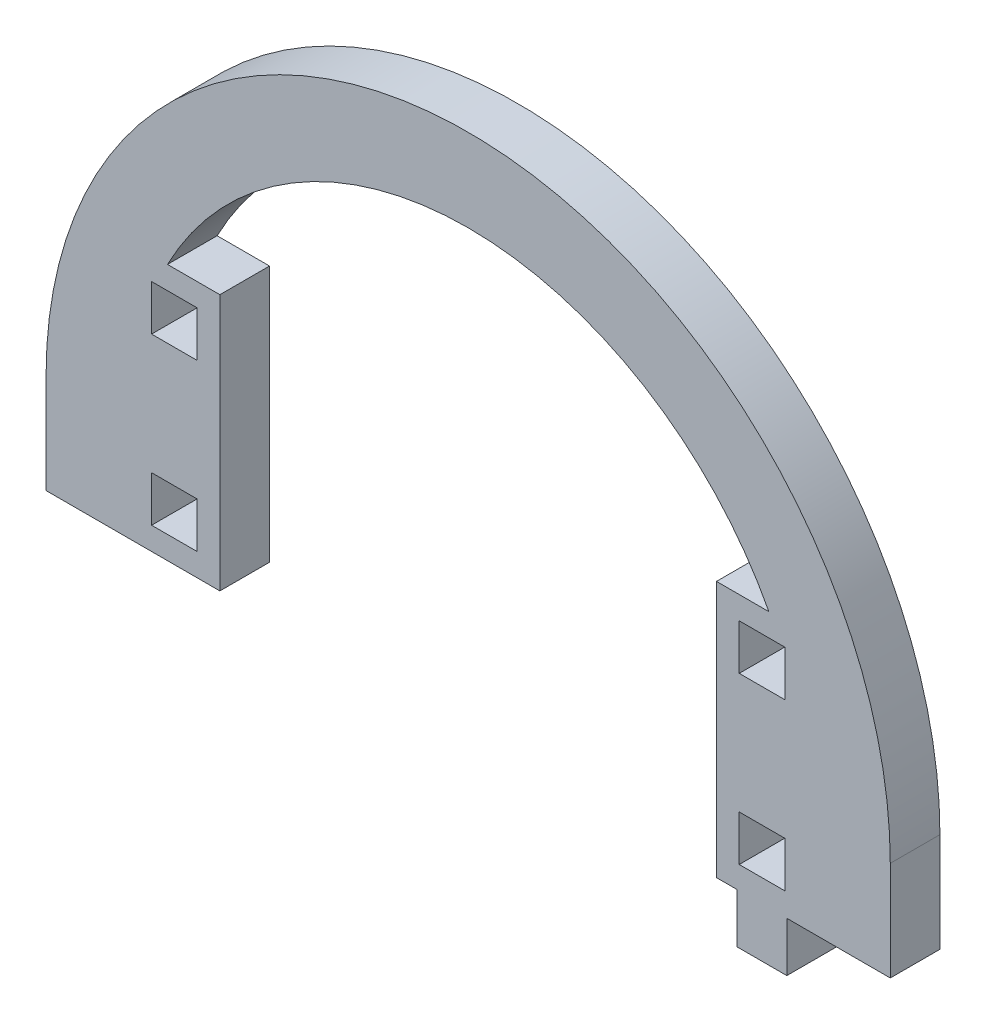
ISO-10303-21;
HEADER;
FILE_DESCRIPTION(('STEP AP214'),'2;1');
FILE_NAME('part.step','',(''),(''),'','','');
FILE_SCHEMA(('AUTOMOTIVE_DESIGN { 1 0 10303 214 1 1 1 1 }'));
ENDSEC;
DATA;
#1=APPLICATION_CONTEXT('core data for automotive mechanical design processes');
#2=APPLICATION_PROTOCOL_DEFINITION('international standard','automotive_design',2000,#1);
#3=PRODUCT_CONTEXT('',#1,'mechanical');
#4=PRODUCT('Part','Part','',(#3));
#5=PRODUCT_RELATED_PRODUCT_CATEGORY('part','',(#4));
#6=PRODUCT_DEFINITION_FORMATION('','',#4);
#7=PRODUCT_DEFINITION_CONTEXT('part definition',#1,'design');
#8=PRODUCT_DEFINITION('design','',#6,#7);
#9=PRODUCT_DEFINITION_SHAPE('','',#8);
#10=(LENGTH_UNIT() NAMED_UNIT(*) SI_UNIT(.MILLI.,.METRE.));
#11=(NAMED_UNIT(*) PLANE_ANGLE_UNIT() SI_UNIT($,.RADIAN.));
#12=(NAMED_UNIT(*) SI_UNIT($,.STERADIAN.) SOLID_ANGLE_UNIT());
#13=UNCERTAINTY_MEASURE_WITH_UNIT(LENGTH_MEASURE(1.E-05),#10,'distance_accuracy_value','');
#14=(GEOMETRIC_REPRESENTATION_CONTEXT(3) GLOBAL_UNCERTAINTY_ASSIGNED_CONTEXT((#13)) GLOBAL_UNIT_ASSIGNED_CONTEXT((#10,
#11,#12)) REPRESENTATION_CONTEXT('',''));
#15=CARTESIAN_POINT('',(0.,0.,0.));
#16=DIRECTION('',(0.,0.,1.));
#17=DIRECTION('',(1.,0.,0.));
#18=AXIS2_PLACEMENT_3D('',#15,#16,#17);
#19=CARTESIAN_POINT('',(3063.61709474341,1236.94724493334,6.));
#20=DIRECTION('',(0.,0.,1.));
#21=DIRECTION('',(1.,0.,0.));
#22=AXIS2_PLACEMENT_3D('',#19,#20,#21);
#23=PLANE('',#22);
#24=CARTESIAN_POINT('',(3063.61709474341,1236.94724493334,6.));
#25=DIRECTION('',(0.,0.,1.));
#26=DIRECTION('',(1.,0.,0.));
#27=AXIS2_PLACEMENT_3D('',#24,#25,#26);
#28=CIRCLE('',#27,50.9999999999999);
#29=CARTESIAN_POINT('',(3114.61709474341,1236.94724493334,6.));
#30=VERTEX_POINT('',#29);
#31=CARTESIAN_POINT('',(3012.61709474341,1236.94724493334,6.));
#32=VERTEX_POINT('',#31);
#33=EDGE_CURVE('E642',#30,#32,#28,.T.);
#34=ORIENTED_EDGE('',*,*,#33,.T.);
#35=DIRECTION('',(0.,-1.,0.));
#36=VECTOR('',#35,1.);
#37=CARTESIAN_POINT('',(3012.61709474341,1236.94724493334,6.));
#38=LINE('',#37,#36);
#39=CARTESIAN_POINT('',(3012.61709474341,1224.94724493334,6.));
#40=VERTEX_POINT('',#39);
#41=EDGE_CURVE('E646',#32,#40,#38,.T.);
#42=ORIENTED_EDGE('',*,*,#41,.T.);
#43=DIRECTION('',(-1.,0.,0.));
#44=VECTOR('',#43,1.);
#45=CARTESIAN_POINT('',(3022.61709474341,1224.94724493334,6.));
#46=LINE('',#45,#44);
#47=CARTESIAN_POINT('',(3033.61709474341,1224.94724493334,6.));
#48=VERTEX_POINT('',#47);
#49=EDGE_CURVE('E650',#48,#40,#46,.T.);
#50=ORIENTED_EDGE('',*,*,#49,.F.);
#51=DIRECTION('',(0.,-1.,0.));
#52=VECTOR('',#51,1.);
#53=CARTESIAN_POINT('',(3033.61709474341,1255.94724493334,6.));
#54=LINE('',#53,#52);
#55=CARTESIAN_POINT('',(3033.61709474341,1255.94724493334,6.));
#56=VERTEX_POINT('',#55);
#57=EDGE_CURVE('E654',#56,#48,#54,.T.);
#58=ORIENTED_EDGE('',*,*,#57,.F.);
#59=DIRECTION('',(-1.,0.,0.));
#60=VECTOR('',#59,1.);
#61=CARTESIAN_POINT('',(3033.61709474341,1255.94724493334,6.));
#62=LINE('',#61,#60);
#63=CARTESIAN_POINT('',(3027.28529049424,1255.94724493334,6.));
#64=VERTEX_POINT('',#63);
#65=EDGE_CURVE('E658',#56,#64,#62,.T.);
#66=ORIENTED_EDGE('',*,*,#65,.T.);
#67=CARTESIAN_POINT('',(3063.61709474341,1236.94724493334,6.));
#68=DIRECTION('',(0.,0.,1.));
#69=DIRECTION('',(1.,0.,0.));
#70=AXIS2_PLACEMENT_3D('',#67,#68,#69);
#71=CIRCLE('',#70,41.0000000000001);
#72=CARTESIAN_POINT('',(3099.94889899258,1255.94724493334,6.));
#73=VERTEX_POINT('',#72);
#74=EDGE_CURVE('E661',#73,#64,#71,.T.);
#75=ORIENTED_EDGE('',*,*,#74,.F.);
#76=DIRECTION('',(-1.,0.,0.));
#77=VECTOR('',#76,1.);
#78=CARTESIAN_POINT('',(3099.94889899258,1255.94724493334,6.));
#79=LINE('',#78,#77);
#80=CARTESIAN_POINT('',(3093.61709474341,1255.94724493334,6.));
#81=VERTEX_POINT('',#80);
#82=EDGE_CURVE('E665',#73,#81,#79,.T.);
#83=ORIENTED_EDGE('',*,*,#82,.T.);
#84=DIRECTION('',(0.,-1.,0.));
#85=VECTOR('',#84,1.);
#86=CARTESIAN_POINT('',(3093.61709474341,1255.94724493334,6.));
#87=LINE('',#86,#85);
#88=CARTESIAN_POINT('',(3093.61709474341,1224.94724493334,6.));
#89=VERTEX_POINT('',#88);
#90=EDGE_CURVE('E668',#81,#89,#87,.T.);
#91=ORIENTED_EDGE('',*,*,#90,.T.);
#92=DIRECTION('',(1.,0.,0.));
#93=VECTOR('',#92,1.);
#94=CARTESIAN_POINT('',(3093.61709474341,1224.94724493334,6.));
#95=LINE('',#94,#93);
#96=CARTESIAN_POINT('',(3096.11709474341,1224.94724493334,6.));
#97=VERTEX_POINT('',#96);
#98=EDGE_CURVE('E671',#89,#97,#95,.T.);
#99=ORIENTED_EDGE('',*,*,#98,.T.);
#100=DIRECTION('',(0.,-1.,0.));
#101=VECTOR('',#100,1.);
#102=CARTESIAN_POINT('',(3096.11709474341,1224.94724493334,6.));
#103=LINE('',#102,#101);
#104=CARTESIAN_POINT('',(3096.11709474341,1218.94724493334,6.));
#105=VERTEX_POINT('',#104);
#106=EDGE_CURVE('E674',#97,#105,#103,.T.);
#107=ORIENTED_EDGE('',*,*,#106,.T.);
#108=DIRECTION('',(1.,0.,0.));
#109=VECTOR('',#108,1.);
#110=CARTESIAN_POINT('',(3096.11709474341,1218.94724493334,6.));
#111=LINE('',#110,#109);
#112=CARTESIAN_POINT('',(3102.11709474341,1218.94724493334,6.));
#113=VERTEX_POINT('',#112);
#114=EDGE_CURVE('E677',#105,#113,#111,.T.);
#115=ORIENTED_EDGE('',*,*,#114,.T.);
#116=DIRECTION('',(0.,1.,0.));
#117=VECTOR('',#116,1.);
#118=CARTESIAN_POINT('',(3102.11709474341,1218.94724493334,6.));
#119=LINE('',#118,#117);
#120=CARTESIAN_POINT('',(3102.11709474341,1224.94724493334,6.));
#121=VERTEX_POINT('',#120);
#122=EDGE_CURVE('E680',#113,#121,#119,.T.);
#123=ORIENTED_EDGE('',*,*,#122,.T.);
#124=DIRECTION('',(1.,0.,0.));
#125=VECTOR('',#124,1.);
#126=CARTESIAN_POINT('',(3102.11709474341,1224.94724493334,6.));
#127=LINE('',#126,#125);
#128=CARTESIAN_POINT('',(3114.61709474341,1224.94724493334,6.));
#129=VERTEX_POINT('',#128);
#130=EDGE_CURVE('E683',#121,#129,#127,.T.);
#131=ORIENTED_EDGE('',*,*,#130,.T.);
#132=DIRECTION('',(0.,-1.,0.));
#133=VECTOR('',#132,1.);
#134=CARTESIAN_POINT('',(3114.61709474341,1236.94724493334,6.));
#135=LINE('',#134,#133);
#136=EDGE_CURVE('E686',#30,#129,#135,.T.);
#137=ORIENTED_EDGE('',*,*,#136,.F.);
#138=EDGE_LOOP('',(#34,#42,#50,#58,#66,#75,#83,#91,#99,#107,#115,#123,#131,#137));
#139=FACE_BOUND('',#138,.T.);
#140=DIRECTION('',(0.,1.,0.));
#141=VECTOR('',#140,1.);
#142=CARTESIAN_POINT('',(3030.86709474341,0.,6.));
#143=LINE('',#142,#141);
#144=CARTESIAN_POINT('',(3030.86709474341,1247.69724493334,6.));
#145=VERTEX_POINT('',#144);
#146=CARTESIAN_POINT('',(3030.86709474341,1253.19724493334,6.));
#147=VERTEX_POINT('',#146);
#148=EDGE_CURVE('E602',#145,#147,#143,.T.);
#149=ORIENTED_EDGE('',*,*,#148,.F.);
#150=DIRECTION('',(1.,0.,0.));
#151=VECTOR('',#150,1.);
#152=CARTESIAN_POINT('',(0.,1247.69724493334,6.));
#153=LINE('',#152,#151);
#154=CARTESIAN_POINT('',(3025.36709474342,1247.69724493334,6.));
#155=VERTEX_POINT('',#154);
#156=EDGE_CURVE('E599',#155,#145,#153,.T.);
#157=ORIENTED_EDGE('',*,*,#156,.F.);
#158=DIRECTION('',(0.,-1.,0.));
#159=VECTOR('',#158,1.);
#160=CARTESIAN_POINT('',(3025.36709474342,0.,6.));
#161=LINE('',#160,#159);
#162=CARTESIAN_POINT('',(3025.36709474342,1253.19724493334,6.));
#163=VERTEX_POINT('',#162);
#164=EDGE_CURVE('E610',#163,#155,#161,.T.);
#165=ORIENTED_EDGE('',*,*,#164,.F.);
#166=DIRECTION('',(-1.,0.,0.));
#167=VECTOR('',#166,1.);
#168=CARTESIAN_POINT('',(0.,1253.19724493334,6.));
#169=LINE('',#168,#167);
#170=EDGE_CURVE('E606',#147,#163,#169,.T.);
#171=ORIENTED_EDGE('',*,*,#170,.F.);
#172=EDGE_LOOP('',(#149,#157,#165,#171));
#173=FACE_BOUND('',#172,.T.);
#174=DIRECTION('',(0.,1.,0.));
#175=VECTOR('',#174,1.);
#176=CARTESIAN_POINT('',(3030.86709474341,0.,6.));
#177=LINE('',#176,#175);
#178=CARTESIAN_POINT('',(3030.86709474341,1227.69724493334,6.));
#179=VERTEX_POINT('',#178);
#180=CARTESIAN_POINT('',(3030.86709474341,1233.19724493334,6.));
#181=VERTEX_POINT('',#180);
#182=EDGE_CURVE('E559',#179,#181,#177,.T.);
#183=ORIENTED_EDGE('',*,*,#182,.F.);
#184=DIRECTION('',(1.,0.,0.));
#185=VECTOR('',#184,1.);
#186=CARTESIAN_POINT('',(0.,1227.69724493334,6.));
#187=LINE('',#186,#185);
#188=CARTESIAN_POINT('',(3025.36709474342,1227.69724493334,6.));
#189=VERTEX_POINT('',#188);
#190=EDGE_CURVE('E556',#189,#179,#187,.T.);
#191=ORIENTED_EDGE('',*,*,#190,.F.);
#192=DIRECTION('',(0.,-1.,0.));
#193=VECTOR('',#192,1.);
#194=CARTESIAN_POINT('',(3025.36709474342,0.,6.));
#195=LINE('',#194,#193);
#196=CARTESIAN_POINT('',(3025.36709474342,1233.19724493334,6.));
#197=VERTEX_POINT('',#196);
#198=EDGE_CURVE('E567',#197,#189,#195,.T.);
#199=ORIENTED_EDGE('',*,*,#198,.F.);
#200=DIRECTION('',(-1.,0.,0.));
#201=VECTOR('',#200,1.);
#202=CARTESIAN_POINT('',(0.,1233.19724493334,6.));
#203=LINE('',#202,#201);
#204=EDGE_CURVE('E563',#181,#197,#203,.T.);
#205=ORIENTED_EDGE('',*,*,#204,.F.);
#206=EDGE_LOOP('',(#183,#191,#199,#205));
#207=FACE_BOUND('',#206,.T.);
#208=DIRECTION('',(0.,1.,0.));
#209=VECTOR('',#208,1.);
#210=CARTESIAN_POINT('',(3101.86709474341,0.,6.));
#211=LINE('',#210,#209);
#212=CARTESIAN_POINT('',(3101.86709474341,1247.69724493334,6.));
#213=VERTEX_POINT('',#212);
#214=CARTESIAN_POINT('',(3101.86709474341,1253.19724493334,6.));
#215=VERTEX_POINT('',#214);
#216=EDGE_CURVE('E516',#213,#215,#211,.T.);
#217=ORIENTED_EDGE('',*,*,#216,.F.);
#218=DIRECTION('',(1.,0.,0.));
#219=VECTOR('',#218,1.);
#220=CARTESIAN_POINT('',(0.,1247.69724493334,6.));
#221=LINE('',#220,#219);
#222=CARTESIAN_POINT('',(3096.36709474341,1247.69724493334,6.));
#223=VERTEX_POINT('',#222);
#224=EDGE_CURVE('E513',#223,#213,#221,.T.);
#225=ORIENTED_EDGE('',*,*,#224,.F.);
#226=DIRECTION('',(0.,-1.,0.));
#227=VECTOR('',#226,1.);
#228=CARTESIAN_POINT('',(3096.36709474341,0.,6.));
#229=LINE('',#228,#227);
#230=CARTESIAN_POINT('',(3096.36709474341,1253.19724493334,6.));
#231=VERTEX_POINT('',#230);
#232=EDGE_CURVE('E524',#231,#223,#229,.T.);
#233=ORIENTED_EDGE('',*,*,#232,.F.);
#234=DIRECTION('',(-1.,0.,0.));
#235=VECTOR('',#234,1.);
#236=CARTESIAN_POINT('',(0.,1253.19724493334,6.));
#237=LINE('',#236,#235);
#238=EDGE_CURVE('E520',#215,#231,#237,.T.);
#239=ORIENTED_EDGE('',*,*,#238,.F.);
#240=EDGE_LOOP('',(#217,#225,#233,#239));
#241=FACE_BOUND('',#240,.T.);
#242=DIRECTION('',(0.,1.,0.));
#243=VECTOR('',#242,1.);
#244=CARTESIAN_POINT('',(3101.86709474341,0.,6.));
#245=LINE('',#244,#243);
#246=CARTESIAN_POINT('',(3101.86709474341,1227.69724493334,6.));
#247=VERTEX_POINT('',#246);
#248=CARTESIAN_POINT('',(3101.86709474341,1233.19724493334,6.));
#249=VERTEX_POINT('',#248);
#250=EDGE_CURVE('E474',#247,#249,#245,.T.);
#251=ORIENTED_EDGE('',*,*,#250,.F.);
#252=DIRECTION('',(1.,0.,0.));
#253=VECTOR('',#252,1.);
#254=CARTESIAN_POINT('',(0.,1227.69724493334,6.));
#255=LINE('',#254,#253);
#256=CARTESIAN_POINT('',(3096.36709474341,1227.69724493334,6.));
#257=VERTEX_POINT('',#256);
#258=EDGE_CURVE('E465',#257,#247,#255,.T.);
#259=ORIENTED_EDGE('',*,*,#258,.F.);
#260=DIRECTION('',(0.,-1.,0.));
#261=VECTOR('',#260,1.);
#262=CARTESIAN_POINT('',(3096.36709474341,0.,6.));
#263=LINE('',#262,#261);
#264=CARTESIAN_POINT('',(3096.36709474341,1233.19724493334,6.));
#265=VERTEX_POINT('',#264);
#266=EDGE_CURVE('E491',#265,#257,#263,.T.);
#267=ORIENTED_EDGE('',*,*,#266,.F.);
#268=DIRECTION('',(-1.,0.,0.));
#269=VECTOR('',#268,1.);
#270=CARTESIAN_POINT('',(0.,1233.19724493334,6.));
#271=LINE('',#270,#269);
#272=EDGE_CURVE('E487',#249,#265,#271,.T.);
#273=ORIENTED_EDGE('',*,*,#272,.F.);
#274=EDGE_LOOP('',(#251,#259,#267,#273));
#275=FACE_BOUND('',#274,.T.);
#276=ADVANCED_FACE('F267',(#139,#173,#207,#241,#275),#23,.T.);
#277=CARTESIAN_POINT('',(3063.61709474341,1236.94724493334,0.));
#278=DIRECTION('',(0.,0.,1.));
#279=DIRECTION('',(1.,0.,0.));
#280=AXIS2_PLACEMENT_3D('',#277,#278,#279);
#281=PLANE('',#280);
#282=DIRECTION('',(1.,0.,0.));
#283=VECTOR('',#282,1.);
#284=CARTESIAN_POINT('',(0.,1247.69724493334,0.));
#285=LINE('',#284,#283);
#286=CARTESIAN_POINT('',(3096.36709474341,1247.69724493334,0.));
#287=VERTEX_POINT('',#286);
#288=CARTESIAN_POINT('',(3101.86709474341,1247.69724493334,0.));
#289=VERTEX_POINT('',#288);
#290=EDGE_CURVE('E483',#287,#289,#285,.T.);
#291=ORIENTED_EDGE('',*,*,#290,.T.);
#292=DIRECTION('',(0.,1.,0.));
#293=VECTOR('',#292,1.);
#294=CARTESIAN_POINT('',(3101.86709474341,0.,0.));
#295=LINE('',#294,#293);
#296=CARTESIAN_POINT('',(3101.86709474341,1253.19724493334,0.));
#297=VERTEX_POINT('',#296);
#298=EDGE_CURVE('E531',#289,#297,#295,.T.);
#299=ORIENTED_EDGE('',*,*,#298,.T.);
#300=DIRECTION('',(-1.,0.,0.));
#301=VECTOR('',#300,1.);
#302=CARTESIAN_POINT('',(0.,1253.19724493334,0.));
#303=LINE('',#302,#301);
#304=CARTESIAN_POINT('',(3096.36709474341,1253.19724493334,0.));
#305=VERTEX_POINT('',#304);
#306=EDGE_CURVE('E535',#297,#305,#303,.T.);
#307=ORIENTED_EDGE('',*,*,#306,.T.);
#308=DIRECTION('',(0.,-1.,0.));
#309=VECTOR('',#308,1.);
#310=CARTESIAN_POINT('',(3096.36709474341,0.,0.));
#311=LINE('',#310,#309);
#312=EDGE_CURVE('E517',#305,#287,#311,.T.);
#313=ORIENTED_EDGE('',*,*,#312,.T.);
#314=EDGE_LOOP('',(#291,#299,#307,#313));
#315=FACE_BOUND('',#314,.T.);
#316=DIRECTION('',(1.,0.,0.));
#317=VECTOR('',#316,1.);
#318=CARTESIAN_POINT('',(0.,1247.69724493334,0.));
#319=LINE('',#318,#317);
#320=CARTESIAN_POINT('',(3025.36709474342,1247.69724493334,0.));
#321=VERTEX_POINT('',#320);
#322=CARTESIAN_POINT('',(3030.86709474341,1247.69724493334,0.));
#323=VERTEX_POINT('',#322);
#324=EDGE_CURVE('E598',#321,#323,#319,.T.);
#325=ORIENTED_EDGE('',*,*,#324,.T.);
#326=DIRECTION('',(0.,1.,0.));
#327=VECTOR('',#326,1.);
#328=CARTESIAN_POINT('',(3030.86709474341,0.,0.));
#329=LINE('',#328,#327);
#330=CARTESIAN_POINT('',(3030.86709474341,1253.19724493334,0.));
#331=VERTEX_POINT('',#330);
#332=EDGE_CURVE('E617',#323,#331,#329,.T.);
#333=ORIENTED_EDGE('',*,*,#332,.T.);
#334=DIRECTION('',(-1.,0.,0.));
#335=VECTOR('',#334,1.);
#336=CARTESIAN_POINT('',(0.,1253.19724493334,0.));
#337=LINE('',#336,#335);
#338=CARTESIAN_POINT('',(3025.36709474342,1253.19724493334,0.));
#339=VERTEX_POINT('',#338);
#340=EDGE_CURVE('E621',#331,#339,#337,.T.);
#341=ORIENTED_EDGE('',*,*,#340,.T.);
#342=DIRECTION('',(0.,-1.,0.));
#343=VECTOR('',#342,1.);
#344=CARTESIAN_POINT('',(3025.36709474342,0.,0.));
#345=LINE('',#344,#343);
#346=EDGE_CURVE('E603',#339,#321,#345,.T.);
#347=ORIENTED_EDGE('',*,*,#346,.T.);
#348=EDGE_LOOP('',(#325,#333,#341,#347));
#349=FACE_BOUND('',#348,.T.);
#350=CARTESIAN_POINT('',(3063.61709474341,1236.94724493334,0.));
#351=DIRECTION('',(0.,0.,1.));
#352=DIRECTION('',(1.,0.,0.));
#353=AXIS2_PLACEMENT_3D('',#350,#351,#352);
#354=CIRCLE('',#353,50.9999999999999);
#355=CARTESIAN_POINT('',(3114.61709474341,1236.94724493334,0.));
#356=VERTEX_POINT('',#355);
#357=CARTESIAN_POINT('',(3012.61709474341,1236.94724493334,0.));
#358=VERTEX_POINT('',#357);
#359=EDGE_CURVE('E641',#356,#358,#354,.T.);
#360=ORIENTED_EDGE('',*,*,#359,.F.);
#361=DIRECTION('',(0.,-1.,0.));
#362=VECTOR('',#361,1.);
#363=CARTESIAN_POINT('',(3114.61709474341,1236.94724493334,0.));
#364=LINE('',#363,#362);
#365=CARTESIAN_POINT('',(3114.61709474341,1224.94724493334,0.));
#366=VERTEX_POINT('',#365);
#367=EDGE_CURVE('E647',#356,#366,#364,.T.);
#368=ORIENTED_EDGE('',*,*,#367,.T.);
#369=DIRECTION('',(1.,0.,0.));
#370=VECTOR('',#369,1.);
#371=CARTESIAN_POINT('',(3102.11709474341,1224.94724493334,0.));
#372=LINE('',#371,#370);
#373=CARTESIAN_POINT('',(3102.11709474341,1224.94724493334,0.));
#374=VERTEX_POINT('',#373);
#375=EDGE_CURVE('E732',#374,#366,#372,.T.);
#376=ORIENTED_EDGE('',*,*,#375,.F.);
#377=DIRECTION('',(0.,1.,0.));
#378=VECTOR('',#377,1.);
#379=CARTESIAN_POINT('',(3102.11709474341,1218.94724493334,0.));
#380=LINE('',#379,#378);
#381=CARTESIAN_POINT('',(3102.11709474341,1218.94724493334,0.));
#382=VERTEX_POINT('',#381);
#383=EDGE_CURVE('E729',#382,#374,#380,.T.);
#384=ORIENTED_EDGE('',*,*,#383,.F.);
#385=DIRECTION('',(1.,0.,0.));
#386=VECTOR('',#385,1.);
#387=CARTESIAN_POINT('',(3096.11709474341,1218.94724493334,0.));
#388=LINE('',#387,#386);
#389=CARTESIAN_POINT('',(3096.11709474341,1218.94724493334,0.));
#390=VERTEX_POINT('',#389);
#391=EDGE_CURVE('E726',#390,#382,#388,.T.);
#392=ORIENTED_EDGE('',*,*,#391,.F.);
#393=DIRECTION('',(0.,-1.,0.));
#394=VECTOR('',#393,1.);
#395=CARTESIAN_POINT('',(3096.11709474341,1224.94724493334,0.));
#396=LINE('',#395,#394);
#397=CARTESIAN_POINT('',(3096.11709474341,1224.94724493334,0.));
#398=VERTEX_POINT('',#397);
#399=EDGE_CURVE('E723',#398,#390,#396,.T.);
#400=ORIENTED_EDGE('',*,*,#399,.F.);
#401=DIRECTION('',(1.,0.,0.));
#402=VECTOR('',#401,1.);
#403=CARTESIAN_POINT('',(3093.61709474341,1224.94724493334,0.));
#404=LINE('',#403,#402);
#405=CARTESIAN_POINT('',(3093.61709474341,1224.94724493334,0.));
#406=VERTEX_POINT('',#405);
#407=EDGE_CURVE('E720',#406,#398,#404,.T.);
#408=ORIENTED_EDGE('',*,*,#407,.F.);
#409=DIRECTION('',(0.,-1.,0.));
#410=VECTOR('',#409,1.);
#411=CARTESIAN_POINT('',(3093.61709474341,1255.94724493334,0.));
#412=LINE('',#411,#410);
#413=CARTESIAN_POINT('',(3093.61709474341,1255.94724493334,0.));
#414=VERTEX_POINT('',#413);
#415=EDGE_CURVE('E717',#414,#406,#412,.T.);
#416=ORIENTED_EDGE('',*,*,#415,.F.);
#417=DIRECTION('',(-1.,0.,0.));
#418=VECTOR('',#417,1.);
#419=CARTESIAN_POINT('',(3099.94889899258,1255.94724493334,0.));
#420=LINE('',#419,#418);
#421=CARTESIAN_POINT('',(3099.94889899258,1255.94724493334,0.));
#422=VERTEX_POINT('',#421);
#423=EDGE_CURVE('E714',#422,#414,#420,.T.);
#424=ORIENTED_EDGE('',*,*,#423,.F.);
#425=CARTESIAN_POINT('',(3063.61709474341,1236.94724493334,0.));
#426=DIRECTION('',(0.,0.,1.));
#427=DIRECTION('',(1.,0.,0.));
#428=AXIS2_PLACEMENT_3D('',#425,#426,#427);
#429=CIRCLE('',#428,41.0000000000001);
#430=CARTESIAN_POINT('',(3027.28529049424,1255.94724493334,0.));
#431=VERTEX_POINT('',#430);
#432=EDGE_CURVE('E710',#422,#431,#429,.T.);
#433=ORIENTED_EDGE('',*,*,#432,.T.);
#434=DIRECTION('',(-1.,0.,0.));
#435=VECTOR('',#434,1.);
#436=CARTESIAN_POINT('',(3033.61709474341,1255.94724493334,0.));
#437=LINE('',#436,#435);
#438=CARTESIAN_POINT('',(3033.61709474341,1255.94724493334,0.));
#439=VERTEX_POINT('',#438);
#440=EDGE_CURVE('E706',#439,#431,#437,.T.);
#441=ORIENTED_EDGE('',*,*,#440,.F.);
#442=DIRECTION('',(0.,-1.,0.));
#443=VECTOR('',#442,1.);
#444=CARTESIAN_POINT('',(3033.61709474341,1255.94724493334,0.));
#445=LINE('',#444,#443);
#446=CARTESIAN_POINT('',(3033.61709474341,1224.94724493334,0.));
#447=VERTEX_POINT('',#446);
#448=EDGE_CURVE('E702',#439,#447,#445,.T.);
#449=ORIENTED_EDGE('',*,*,#448,.T.);
#450=DIRECTION('',(1.,0.,0.));
#451=VECTOR('',#450,1.);
#452=CARTESIAN_POINT('',(3022.61709474341,1224.94724493334,0.));
#453=LINE('',#452,#451);
#454=CARTESIAN_POINT('',(3012.61709474341,1224.94724493334,0.));
#455=VERTEX_POINT('',#454);
#456=EDGE_CURVE('E698',#455,#447,#453,.T.);
#457=ORIENTED_EDGE('',*,*,#456,.F.);
#458=DIRECTION('',(0.,-1.,0.));
#459=VECTOR('',#458,1.);
#460=CARTESIAN_POINT('',(3012.61709474341,1236.94724493334,0.));
#461=LINE('',#460,#459);
#462=EDGE_CURVE('E694',#358,#455,#461,.T.);
#463=ORIENTED_EDGE('',*,*,#462,.F.);
#464=EDGE_LOOP('',(#360,#368,#376,#384,#392,#400,#408,#416,#424,#433,#441,#449,#457,#463));
#465=FACE_BOUND('',#464,.T.);
#466=DIRECTION('',(1.,0.,0.));
#467=VECTOR('',#466,1.);
#468=CARTESIAN_POINT('',(0.,1227.69724493334,0.));
#469=LINE('',#468,#467);
#470=CARTESIAN_POINT('',(3025.36709474342,1227.69724493334,0.));
#471=VERTEX_POINT('',#470);
#472=CARTESIAN_POINT('',(3030.86709474341,1227.69724493334,0.));
#473=VERTEX_POINT('',#472);
#474=EDGE_CURVE('E555',#471,#473,#469,.T.);
#475=ORIENTED_EDGE('',*,*,#474,.T.);
#476=DIRECTION('',(0.,1.,0.));
#477=VECTOR('',#476,1.);
#478=CARTESIAN_POINT('',(3030.86709474341,0.,0.));
#479=LINE('',#478,#477);
#480=CARTESIAN_POINT('',(3030.86709474341,1233.19724493334,0.));
#481=VERTEX_POINT('',#480);
#482=EDGE_CURVE('E574',#473,#481,#479,.T.);
#483=ORIENTED_EDGE('',*,*,#482,.T.);
#484=DIRECTION('',(-1.,0.,0.));
#485=VECTOR('',#484,1.);
#486=CARTESIAN_POINT('',(0.,1233.19724493334,0.));
#487=LINE('',#486,#485);
#488=CARTESIAN_POINT('',(3025.36709474342,1233.19724493334,0.));
#489=VERTEX_POINT('',#488);
#490=EDGE_CURVE('E578',#481,#489,#487,.T.);
#491=ORIENTED_EDGE('',*,*,#490,.T.);
#492=DIRECTION('',(0.,-1.,0.));
#493=VECTOR('',#492,1.);
#494=CARTESIAN_POINT('',(3025.36709474342,0.,0.));
#495=LINE('',#494,#493);
#496=EDGE_CURVE('E560',#489,#471,#495,.T.);
#497=ORIENTED_EDGE('',*,*,#496,.T.);
#498=EDGE_LOOP('',(#475,#483,#491,#497));
#499=FACE_BOUND('',#498,.T.);
#500=DIRECTION('',(1.,0.,0.));
#501=VECTOR('',#500,1.);
#502=CARTESIAN_POINT('',(0.,1227.69724493334,0.));
#503=LINE('',#502,#501);
#504=CARTESIAN_POINT('',(3096.36709474341,1227.69724493334,0.));
#505=VERTEX_POINT('',#504);
#506=CARTESIAN_POINT('',(3101.86709474341,1227.69724493334,0.));
#507=VERTEX_POINT('',#506);
#508=EDGE_CURVE('E291',#505,#507,#503,.T.);
#509=ORIENTED_EDGE('',*,*,#508,.T.);
#510=DIRECTION('',(0.,1.,0.));
#511=VECTOR('',#510,1.);
#512=CARTESIAN_POINT('',(3101.86709474341,0.,0.));
#513=LINE('',#512,#511);
#514=CARTESIAN_POINT('',(3101.86709474341,1233.19724493334,0.));
#515=VERTEX_POINT('',#514);
#516=EDGE_CURVE('E481',#507,#515,#513,.T.);
#517=ORIENTED_EDGE('',*,*,#516,.T.);
#518=DIRECTION('',(-1.,0.,0.));
#519=VECTOR('',#518,1.);
#520=CARTESIAN_POINT('',(0.,1233.19724493334,0.));
#521=LINE('',#520,#519);
#522=CARTESIAN_POINT('',(3096.36709474341,1233.19724493334,0.));
#523=VERTEX_POINT('',#522);
#524=EDGE_CURVE('E500',#515,#523,#521,.T.);
#525=ORIENTED_EDGE('',*,*,#524,.T.);
#526=DIRECTION('',(0.,-1.,0.));
#527=VECTOR('',#526,1.);
#528=CARTESIAN_POINT('',(3096.36709474341,0.,0.));
#529=LINE('',#528,#527);
#530=EDGE_CURVE('E475',#523,#505,#529,.T.);
#531=ORIENTED_EDGE('',*,*,#530,.T.);
#532=EDGE_LOOP('',(#509,#517,#525,#531));
#533=FACE_BOUND('',#532,.T.);
#534=ADVANCED_FACE('F790',(#315,#349,#465,#499,#533),#281,.F.);
#535=CARTESIAN_POINT('',(3063.61709474341,1236.94724493334,6.));
#536=DIRECTION('',(0.,0.,-1.));
#537=DIRECTION('',(-1.,0.,0.));
#538=AXIS2_PLACEMENT_3D('',#535,#536,#537);
#539=CYLINDRICAL_SURFACE('',#538,50.9999999999999);
#540=ORIENTED_EDGE('',*,*,#359,.T.);
#541=DIRECTION('',(0.,0.,-1.));
#542=VECTOR('',#541,1.);
#543=CARTESIAN_POINT('',(3012.61709474341,1236.94724493334,6.));
#544=LINE('',#543,#542);
#545=EDGE_CURVE('E12',#32,#358,#544,.T.);
#546=ORIENTED_EDGE('',*,*,#545,.F.);
#547=ORIENTED_EDGE('',*,*,#33,.F.);
#548=DIRECTION('',(0.,0.,-1.));
#549=VECTOR('',#548,1.);
#550=CARTESIAN_POINT('',(3114.61709474341,1236.94724493334,6.));
#551=LINE('',#550,#549);
#552=EDGE_CURVE('E690',#30,#356,#551,.T.);
#553=ORIENTED_EDGE('',*,*,#552,.T.);
#554=EDGE_LOOP('',(#540,#546,#547,#553));
#555=FACE_BOUND('',#554,.T.);
#556=ADVANCED_FACE('F269',(#555),#539,.T.);
#557=CARTESIAN_POINT('',(3012.61709474341,1236.94724493334,6.));
#558=DIRECTION('',(1.,0.,0.));
#559=DIRECTION('',(0.,0.,-1.));
#560=AXIS2_PLACEMENT_3D('',#557,#558,#559);
#561=PLANE('',#560);
#562=ORIENTED_EDGE('',*,*,#462,.T.);
#563=DIRECTION('',(0.,0.,-1.));
#564=VECTOR('',#563,1.);
#565=CARTESIAN_POINT('',(3012.61709474341,1224.94724493334,6.));
#566=LINE('',#565,#564);
#567=EDGE_CURVE('E276',#40,#455,#566,.T.);
#568=ORIENTED_EDGE('',*,*,#567,.F.);
#569=ORIENTED_EDGE('',*,*,#41,.F.);
#570=ORIENTED_EDGE('',*,*,#545,.T.);
#571=EDGE_LOOP('',(#562,#568,#569,#570));
#572=FACE_BOUND('',#571,.T.);
#573=ADVANCED_FACE('F786',(#572),#561,.F.);
#574=CARTESIAN_POINT('',(3022.61709474341,1224.94724493334,6.));
#575=DIRECTION('',(0.,1.,0.));
#576=DIRECTION('',(0.,0.,1.));
#577=AXIS2_PLACEMENT_3D('',#574,#575,#576);
#578=PLANE('',#577);
#579=ORIENTED_EDGE('',*,*,#456,.T.);
#580=DIRECTION('',(0.,0.,-1.));
#581=VECTOR('',#580,1.);
#582=CARTESIAN_POINT('',(3033.61709474341,1224.94724493334,6.));
#583=LINE('',#582,#581);
#584=EDGE_CURVE('E777',#48,#447,#583,.T.);
#585=ORIENTED_EDGE('',*,*,#584,.F.);
#586=ORIENTED_EDGE('',*,*,#49,.T.);
#587=ORIENTED_EDGE('',*,*,#567,.T.);
#588=EDGE_LOOP('',(#579,#585,#586,#587));
#589=FACE_BOUND('',#588,.T.);
#590=ADVANCED_FACE('F783',(#589),#578,.F.);
#591=CARTESIAN_POINT('',(3033.61709474341,1255.94724493334,6.));
#592=DIRECTION('',(1.,0.,0.));
#593=DIRECTION('',(0.,0.,-1.));
#594=AXIS2_PLACEMENT_3D('',#591,#592,#593);
#595=PLANE('',#594);
#596=ORIENTED_EDGE('',*,*,#448,.F.);
#597=DIRECTION('',(0.,0.,-1.));
#598=VECTOR('',#597,1.);
#599=CARTESIAN_POINT('',(3033.61709474341,1255.94724493334,6.));
#600=LINE('',#599,#598);
#601=EDGE_CURVE('E774',#56,#439,#600,.T.);
#602=ORIENTED_EDGE('',*,*,#601,.F.);
#603=ORIENTED_EDGE('',*,*,#57,.T.);
#604=ORIENTED_EDGE('',*,*,#584,.T.);
#605=EDGE_LOOP('',(#596,#602,#603,#604));
#606=FACE_BOUND('',#605,.T.);
#607=ADVANCED_FACE('F796',(#606),#595,.T.);
#608=CARTESIAN_POINT('',(3033.61709474341,1255.94724493334,6.));
#609=DIRECTION('',(0.,-1.,0.));
#610=DIRECTION('',(0.,0.,-1.));
#611=AXIS2_PLACEMENT_3D('',#608,#609,#610);
#612=PLANE('',#611);
#613=ORIENTED_EDGE('',*,*,#440,.T.);
#614=DIRECTION('',(0.,0.,-1.));
#615=VECTOR('',#614,1.);
#616=CARTESIAN_POINT('',(3027.28529049424,1255.94724493334,6.));
#617=LINE('',#616,#615);
#618=EDGE_CURVE('E771',#64,#431,#617,.T.);
#619=ORIENTED_EDGE('',*,*,#618,.F.);
#620=ORIENTED_EDGE('',*,*,#65,.F.);
#621=ORIENTED_EDGE('',*,*,#601,.T.);
#622=EDGE_LOOP('',(#613,#619,#620,#621));
#623=FACE_BOUND('',#622,.T.);
#624=ADVANCED_FACE('F846',(#623),#612,.F.);
#625=CARTESIAN_POINT('',(3063.61709474341,1236.94724493334,6.));
#626=DIRECTION('',(0.,0.,-1.));
#627=DIRECTION('',(-1.,0.,0.));
#628=AXIS2_PLACEMENT_3D('',#625,#626,#627);
#629=CYLINDRICAL_SURFACE('',#628,41.0000000000001);
#630=ORIENTED_EDGE('',*,*,#432,.F.);
#631=DIRECTION('',(0.,0.,-1.));
#632=VECTOR('',#631,1.);
#633=CARTESIAN_POINT('',(3099.94889899258,1255.94724493334,6.));
#634=LINE('',#633,#632);
#635=EDGE_CURVE('E768',#73,#422,#634,.T.);
#636=ORIENTED_EDGE('',*,*,#635,.F.);
#637=ORIENTED_EDGE('',*,*,#74,.T.);
#638=ORIENTED_EDGE('',*,*,#618,.T.);
#639=EDGE_LOOP('',(#630,#636,#637,#638));
#640=FACE_BOUND('',#639,.T.);
#641=ADVANCED_FACE('F843',(#640),#629,.F.);
#642=CARTESIAN_POINT('',(3099.94889899258,1255.94724493334,6.));
#643=DIRECTION('',(0.,-1.,0.));
#644=DIRECTION('',(0.,0.,-1.));
#645=AXIS2_PLACEMENT_3D('',#642,#643,#644);
#646=PLANE('',#645);
#647=ORIENTED_EDGE('',*,*,#423,.T.);
#648=DIRECTION('',(0.,0.,-1.));
#649=VECTOR('',#648,1.);
#650=CARTESIAN_POINT('',(3093.61709474341,1255.94724493334,6.));
#651=LINE('',#650,#649);
#652=EDGE_CURVE('E764',#81,#414,#651,.T.);
#653=ORIENTED_EDGE('',*,*,#652,.F.);
#654=ORIENTED_EDGE('',*,*,#82,.F.);
#655=ORIENTED_EDGE('',*,*,#635,.T.);
#656=EDGE_LOOP('',(#647,#653,#654,#655));
#657=FACE_BOUND('',#656,.T.);
#658=ADVANCED_FACE('F853',(#657),#646,.F.);
#659=CARTESIAN_POINT('',(3093.61709474341,1255.94724493334,6.));
#660=DIRECTION('',(1.,0.,0.));
#661=DIRECTION('',(0.,0.,-1.));
#662=AXIS2_PLACEMENT_3D('',#659,#660,#661);
#663=PLANE('',#662);
#664=ORIENTED_EDGE('',*,*,#415,.T.);
#665=DIRECTION('',(0.,0.,-1.));
#666=VECTOR('',#665,1.);
#667=CARTESIAN_POINT('',(3093.61709474341,1224.94724493334,6.));
#668=LINE('',#667,#666);
#669=EDGE_CURVE('E760',#89,#406,#668,.T.);
#670=ORIENTED_EDGE('',*,*,#669,.F.);
#671=ORIENTED_EDGE('',*,*,#90,.F.);
#672=ORIENTED_EDGE('',*,*,#652,.T.);
#673=EDGE_LOOP('',(#664,#670,#671,#672));
#674=FACE_BOUND('',#673,.T.);
#675=ADVANCED_FACE('F837',(#674),#663,.F.);
#676=CARTESIAN_POINT('',(3093.61709474341,1224.94724493334,6.));
#677=DIRECTION('',(0.,1.,0.));
#678=DIRECTION('',(0.,0.,1.));
#679=AXIS2_PLACEMENT_3D('',#676,#677,#678);
#680=PLANE('',#679);
#681=ORIENTED_EDGE('',*,*,#407,.T.);
#682=DIRECTION('',(0.,0.,-1.));
#683=VECTOR('',#682,1.);
#684=CARTESIAN_POINT('',(3096.11709474341,1224.94724493334,6.));
#685=LINE('',#684,#683);
#686=EDGE_CURVE('E756',#97,#398,#685,.T.);
#687=ORIENTED_EDGE('',*,*,#686,.F.);
#688=ORIENTED_EDGE('',*,*,#98,.F.);
#689=ORIENTED_EDGE('',*,*,#669,.T.);
#690=EDGE_LOOP('',(#681,#687,#688,#689));
#691=FACE_BOUND('',#690,.T.);
#692=ADVANCED_FACE('F833',(#691),#680,.F.);
#693=CARTESIAN_POINT('',(3096.11709474341,1224.94724493334,6.));
#694=DIRECTION('',(1.,0.,0.));
#695=DIRECTION('',(0.,0.,-1.));
#696=AXIS2_PLACEMENT_3D('',#693,#694,#695);
#697=PLANE('',#696);
#698=ORIENTED_EDGE('',*,*,#399,.T.);
#699=DIRECTION('',(0.,0.,-1.));
#700=VECTOR('',#699,1.);
#701=CARTESIAN_POINT('',(3096.11709474341,1218.94724493334,6.));
#702=LINE('',#701,#700);
#703=EDGE_CURVE('E752',#105,#390,#702,.T.);
#704=ORIENTED_EDGE('',*,*,#703,.F.);
#705=ORIENTED_EDGE('',*,*,#106,.F.);
#706=ORIENTED_EDGE('',*,*,#686,.T.);
#707=EDGE_LOOP('',(#698,#704,#705,#706));
#708=FACE_BOUND('',#707,.T.);
#709=ADVANCED_FACE('F828',(#708),#697,.F.);
#710=CARTESIAN_POINT('',(3096.11709474341,1218.94724493334,6.));
#711=DIRECTION('',(0.,1.,0.));
#712=DIRECTION('',(0.,0.,1.));
#713=AXIS2_PLACEMENT_3D('',#710,#711,#712);
#714=PLANE('',#713);
#715=ORIENTED_EDGE('',*,*,#391,.T.);
#716=DIRECTION('',(0.,0.,-1.));
#717=VECTOR('',#716,1.);
#718=CARTESIAN_POINT('',(3102.11709474341,1218.94724493334,6.));
#719=LINE('',#718,#717);
#720=EDGE_CURVE('E748',#113,#382,#719,.T.);
#721=ORIENTED_EDGE('',*,*,#720,.F.);
#722=ORIENTED_EDGE('',*,*,#114,.F.);
#723=ORIENTED_EDGE('',*,*,#703,.T.);
#724=EDGE_LOOP('',(#715,#721,#722,#723));
#725=FACE_BOUND('',#724,.T.);
#726=ADVANCED_FACE('F822',(#725),#714,.F.);
#727=CARTESIAN_POINT('',(3102.11709474341,1218.94724493334,6.));
#728=DIRECTION('',(-1.,0.,0.));
#729=DIRECTION('',(0.,0.,1.));
#730=AXIS2_PLACEMENT_3D('',#727,#728,#729);
#731=PLANE('',#730);
#732=ORIENTED_EDGE('',*,*,#383,.T.);
#733=DIRECTION('',(0.,0.,-1.));
#734=VECTOR('',#733,1.);
#735=CARTESIAN_POINT('',(3102.11709474341,1224.94724493334,6.));
#736=LINE('',#735,#734);
#737=EDGE_CURVE('E744',#121,#374,#736,.T.);
#738=ORIENTED_EDGE('',*,*,#737,.F.);
#739=ORIENTED_EDGE('',*,*,#122,.F.);
#740=ORIENTED_EDGE('',*,*,#720,.T.);
#741=EDGE_LOOP('',(#732,#738,#739,#740));
#742=FACE_BOUND('',#741,.T.);
#743=ADVANCED_FACE('F818',(#742),#731,.F.);
#744=CARTESIAN_POINT('',(3102.11709474341,1224.94724493334,6.));
#745=DIRECTION('',(0.,1.,0.));
#746=DIRECTION('',(0.,0.,1.));
#747=AXIS2_PLACEMENT_3D('',#744,#745,#746);
#748=PLANE('',#747);
#749=ORIENTED_EDGE('',*,*,#375,.T.);
#750=DIRECTION('',(0.,0.,-1.));
#751=VECTOR('',#750,1.);
#752=CARTESIAN_POINT('',(3114.61709474341,1224.94724493334,6.));
#753=LINE('',#752,#751);
#754=EDGE_CURVE('E741',#129,#366,#753,.T.);
#755=ORIENTED_EDGE('',*,*,#754,.F.);
#756=ORIENTED_EDGE('',*,*,#130,.F.);
#757=ORIENTED_EDGE('',*,*,#737,.T.);
#758=EDGE_LOOP('',(#749,#755,#756,#757));
#759=FACE_BOUND('',#758,.T.);
#760=ADVANCED_FACE('F813',(#759),#748,.F.);
#761=CARTESIAN_POINT('',(3114.61709474341,1236.94724493334,6.));
#762=DIRECTION('',(1.,0.,0.));
#763=DIRECTION('',(0.,0.,-1.));
#764=AXIS2_PLACEMENT_3D('',#761,#762,#763);
#765=PLANE('',#764);
#766=ORIENTED_EDGE('',*,*,#367,.F.);
#767=ORIENTED_EDGE('',*,*,#552,.F.);
#768=ORIENTED_EDGE('',*,*,#136,.T.);
#769=ORIENTED_EDGE('',*,*,#754,.T.);
#770=EDGE_LOOP('',(#766,#767,#768,#769));
#771=FACE_BOUND('',#770,.T.);
#772=ADVANCED_FACE('F807',(#771),#765,.T.);
#773=CARTESIAN_POINT('',(0.,1247.69724493334,6.));
#774=DIRECTION('',(0.,1.,0.));
#775=DIRECTION('',(0.,0.,1.));
#776=AXIS2_PLACEMENT_3D('',#773,#774,#775);
#777=PLANE('',#776);
#778=ORIENTED_EDGE('',*,*,#324,.F.);
#779=DIRECTION('',(0.,0.,-1.));
#780=VECTOR('',#779,1.);
#781=CARTESIAN_POINT('',(3025.36709474342,1247.69724493334,6.));
#782=LINE('',#781,#780);
#783=EDGE_CURVE('E613',#155,#321,#782,.T.);
#784=ORIENTED_EDGE('',*,*,#783,.F.);
#785=ORIENTED_EDGE('',*,*,#156,.T.);
#786=DIRECTION('',(0.,0.,-1.));
#787=VECTOR('',#786,1.);
#788=CARTESIAN_POINT('',(3030.86709474341,1247.69724493334,6.));
#789=LINE('',#788,#787);
#790=EDGE_CURVE('E637',#145,#323,#789,.T.);
#791=ORIENTED_EDGE('',*,*,#790,.T.);
#792=EDGE_LOOP('',(#778,#784,#785,#791));
#793=FACE_BOUND('',#792,.T.);
#794=ADVANCED_FACE('F864',(#793),#777,.T.);
#795=CARTESIAN_POINT('',(3030.86709474341,0.,6.));
#796=DIRECTION('',(-1.,0.,0.));
#797=DIRECTION('',(0.,0.,1.));
#798=AXIS2_PLACEMENT_3D('',#795,#796,#797);
#799=PLANE('',#798);
#800=ORIENTED_EDGE('',*,*,#332,.F.);
#801=ORIENTED_EDGE('',*,*,#790,.F.);
#802=ORIENTED_EDGE('',*,*,#148,.T.);
#803=DIRECTION('',(0.,0.,-1.));
#804=VECTOR('',#803,1.);
#805=CARTESIAN_POINT('',(3030.86709474341,1253.19724493334,6.));
#806=LINE('',#805,#804);
#807=EDGE_CURVE('E634',#147,#331,#806,.T.);
#808=ORIENTED_EDGE('',*,*,#807,.T.);
#809=EDGE_LOOP('',(#800,#801,#802,#808));
#810=FACE_BOUND('',#809,.T.);
#811=ADVANCED_FACE('F920',(#810),#799,.T.);
#812=CARTESIAN_POINT('',(0.,1253.19724493334,6.));
#813=DIRECTION('',(0.,-1.,0.));
#814=DIRECTION('',(0.,0.,-1.));
#815=AXIS2_PLACEMENT_3D('',#812,#813,#814);
#816=PLANE('',#815);
#817=ORIENTED_EDGE('',*,*,#340,.F.);
#818=ORIENTED_EDGE('',*,*,#807,.F.);
#819=ORIENTED_EDGE('',*,*,#170,.T.);
#820=DIRECTION('',(0.,0.,-1.));
#821=VECTOR('',#820,1.);
#822=CARTESIAN_POINT('',(3025.36709474342,1253.19724493334,6.));
#823=LINE('',#822,#821);
#824=EDGE_CURVE('E631',#163,#339,#823,.T.);
#825=ORIENTED_EDGE('',*,*,#824,.T.);
#826=EDGE_LOOP('',(#817,#818,#819,#825));
#827=FACE_BOUND('',#826,.T.);
#828=ADVANCED_FACE('F927',(#827),#816,.T.);
#829=CARTESIAN_POINT('',(3025.36709474342,0.,6.));
#830=DIRECTION('',(1.,0.,0.));
#831=DIRECTION('',(0.,0.,-1.));
#832=AXIS2_PLACEMENT_3D('',#829,#830,#831);
#833=PLANE('',#832);
#834=ORIENTED_EDGE('',*,*,#346,.F.);
#835=ORIENTED_EDGE('',*,*,#824,.F.);
#836=ORIENTED_EDGE('',*,*,#164,.T.);
#837=ORIENTED_EDGE('',*,*,#783,.T.);
#838=EDGE_LOOP('',(#834,#835,#836,#837));
#839=FACE_BOUND('',#838,.T.);
#840=ADVANCED_FACE('F934',(#839),#833,.T.);
#841=CARTESIAN_POINT('',(0.,1227.69724493334,6.));
#842=DIRECTION('',(0.,1.,0.));
#843=DIRECTION('',(0.,0.,1.));
#844=AXIS2_PLACEMENT_3D('',#841,#842,#843);
#845=PLANE('',#844);
#846=ORIENTED_EDGE('',*,*,#474,.F.);
#847=DIRECTION('',(0.,0.,-1.));
#848=VECTOR('',#847,1.);
#849=CARTESIAN_POINT('',(3025.36709474342,1227.69724493334,6.));
#850=LINE('',#849,#848);
#851=EDGE_CURVE('E570',#189,#471,#850,.T.);
#852=ORIENTED_EDGE('',*,*,#851,.F.);
#853=ORIENTED_EDGE('',*,*,#190,.T.);
#854=DIRECTION('',(0.,0.,-1.));
#855=VECTOR('',#854,1.);
#856=CARTESIAN_POINT('',(3030.86709474341,1227.69724493334,6.));
#857=LINE('',#856,#855);
#858=EDGE_CURVE('E594',#179,#473,#857,.T.);
#859=ORIENTED_EDGE('',*,*,#858,.T.);
#860=EDGE_LOOP('',(#846,#852,#853,#859));
#861=FACE_BOUND('',#860,.T.);
#862=ADVANCED_FACE('F942',(#861),#845,.T.);
#863=CARTESIAN_POINT('',(3030.86709474341,0.,6.));
#864=DIRECTION('',(-1.,0.,0.));
#865=DIRECTION('',(0.,0.,1.));
#866=AXIS2_PLACEMENT_3D('',#863,#864,#865);
#867=PLANE('',#866);
#868=ORIENTED_EDGE('',*,*,#482,.F.);
#869=ORIENTED_EDGE('',*,*,#858,.F.);
#870=ORIENTED_EDGE('',*,*,#182,.T.);
#871=DIRECTION('',(0.,0.,-1.));
#872=VECTOR('',#871,1.);
#873=CARTESIAN_POINT('',(3030.86709474341,1233.19724493334,6.));
#874=LINE('',#873,#872);
#875=EDGE_CURVE('E591',#181,#481,#874,.T.);
#876=ORIENTED_EDGE('',*,*,#875,.T.);
#877=EDGE_LOOP('',(#868,#869,#870,#876));
#878=FACE_BOUND('',#877,.T.);
#879=ADVANCED_FACE('F950',(#878),#867,.T.);
#880=CARTESIAN_POINT('',(0.,1233.19724493334,6.));
#881=DIRECTION('',(0.,-1.,0.));
#882=DIRECTION('',(0.,0.,-1.));
#883=AXIS2_PLACEMENT_3D('',#880,#881,#882);
#884=PLANE('',#883);
#885=ORIENTED_EDGE('',*,*,#490,.F.);
#886=ORIENTED_EDGE('',*,*,#875,.F.);
#887=ORIENTED_EDGE('',*,*,#204,.T.);
#888=DIRECTION('',(0.,0.,-1.));
#889=VECTOR('',#888,1.);
#890=CARTESIAN_POINT('',(3025.36709474342,1233.19724493334,6.));
#891=LINE('',#890,#889);
#892=EDGE_CURVE('E588',#197,#489,#891,.T.);
#893=ORIENTED_EDGE('',*,*,#892,.T.);
#894=EDGE_LOOP('',(#885,#886,#887,#893));
#895=FACE_BOUND('',#894,.T.);
#896=ADVANCED_FACE('F958',(#895),#884,.T.);
#897=CARTESIAN_POINT('',(3025.36709474342,0.,6.));
#898=DIRECTION('',(1.,0.,0.));
#899=DIRECTION('',(0.,0.,-1.));
#900=AXIS2_PLACEMENT_3D('',#897,#898,#899);
#901=PLANE('',#900);
#902=ORIENTED_EDGE('',*,*,#496,.F.);
#903=ORIENTED_EDGE('',*,*,#892,.F.);
#904=ORIENTED_EDGE('',*,*,#198,.T.);
#905=ORIENTED_EDGE('',*,*,#851,.T.);
#906=EDGE_LOOP('',(#902,#903,#904,#905));
#907=FACE_BOUND('',#906,.T.);
#908=ADVANCED_FACE('F966',(#907),#901,.T.);
#909=CARTESIAN_POINT('',(0.,1247.69724493334,6.));
#910=DIRECTION('',(0.,1.,0.));
#911=DIRECTION('',(0.,0.,1.));
#912=AXIS2_PLACEMENT_3D('',#909,#910,#911);
#913=PLANE('',#912);
#914=ORIENTED_EDGE('',*,*,#290,.F.);
#915=DIRECTION('',(0.,0.,-1.));
#916=VECTOR('',#915,1.);
#917=CARTESIAN_POINT('',(3096.36709474341,1247.69724493334,6.));
#918=LINE('',#917,#916);
#919=EDGE_CURVE('E527',#223,#287,#918,.T.);
#920=ORIENTED_EDGE('',*,*,#919,.F.);
#921=ORIENTED_EDGE('',*,*,#224,.T.);
#922=DIRECTION('',(0.,0.,-1.));
#923=VECTOR('',#922,1.);
#924=CARTESIAN_POINT('',(3101.86709474341,1247.69724493334,6.));
#925=LINE('',#924,#923);
#926=EDGE_CURVE('E551',#213,#289,#925,.T.);
#927=ORIENTED_EDGE('',*,*,#926,.T.);
#928=EDGE_LOOP('',(#914,#920,#921,#927));
#929=FACE_BOUND('',#928,.T.);
#930=ADVANCED_FACE('F974',(#929),#913,.T.);
#931=CARTESIAN_POINT('',(3101.86709474341,0.,6.));
#932=DIRECTION('',(-1.,0.,0.));
#933=DIRECTION('',(0.,0.,1.));
#934=AXIS2_PLACEMENT_3D('',#931,#932,#933);
#935=PLANE('',#934);
#936=ORIENTED_EDGE('',*,*,#298,.F.);
#937=ORIENTED_EDGE('',*,*,#926,.F.);
#938=ORIENTED_EDGE('',*,*,#216,.T.);
#939=DIRECTION('',(0.,0.,-1.));
#940=VECTOR('',#939,1.);
#941=CARTESIAN_POINT('',(3101.86709474341,1253.19724493334,6.));
#942=LINE('',#941,#940);
#943=EDGE_CURVE('E548',#215,#297,#942,.T.);
#944=ORIENTED_EDGE('',*,*,#943,.T.);
#945=EDGE_LOOP('',(#936,#937,#938,#944));
#946=FACE_BOUND('',#945,.T.);
#947=ADVANCED_FACE('F982',(#946),#935,.T.);
#948=CARTESIAN_POINT('',(0.,1253.19724493334,6.));
#949=DIRECTION('',(0.,-1.,0.));
#950=DIRECTION('',(0.,0.,-1.));
#951=AXIS2_PLACEMENT_3D('',#948,#949,#950);
#952=PLANE('',#951);
#953=ORIENTED_EDGE('',*,*,#306,.F.);
#954=ORIENTED_EDGE('',*,*,#943,.F.);
#955=ORIENTED_EDGE('',*,*,#238,.T.);
#956=DIRECTION('',(0.,0.,-1.));
#957=VECTOR('',#956,1.);
#958=CARTESIAN_POINT('',(3096.36709474341,1253.19724493334,6.));
#959=LINE('',#958,#957);
#960=EDGE_CURVE('E545',#231,#305,#959,.T.);
#961=ORIENTED_EDGE('',*,*,#960,.T.);
#962=EDGE_LOOP('',(#953,#954,#955,#961));
#963=FACE_BOUND('',#962,.T.);
#964=ADVANCED_FACE('F990',(#963),#952,.T.);
#965=CARTESIAN_POINT('',(3096.36709474341,0.,6.));
#966=DIRECTION('',(1.,0.,0.));
#967=DIRECTION('',(0.,0.,-1.));
#968=AXIS2_PLACEMENT_3D('',#965,#966,#967);
#969=PLANE('',#968);
#970=ORIENTED_EDGE('',*,*,#312,.F.);
#971=ORIENTED_EDGE('',*,*,#960,.F.);
#972=ORIENTED_EDGE('',*,*,#232,.T.);
#973=ORIENTED_EDGE('',*,*,#919,.T.);
#974=EDGE_LOOP('',(#970,#971,#972,#973));
#975=FACE_BOUND('',#974,.T.);
#976=ADVANCED_FACE('F998',(#975),#969,.T.);
#977=CARTESIAN_POINT('',(0.,1227.69724493334,6.));
#978=DIRECTION('',(0.,1.,0.));
#979=DIRECTION('',(0.,0.,1.));
#980=AXIS2_PLACEMENT_3D('',#977,#978,#979);
#981=PLANE('',#980);
#982=ORIENTED_EDGE('',*,*,#508,.F.);
#983=DIRECTION('',(0.,0.,-1.));
#984=VECTOR('',#983,1.);
#985=CARTESIAN_POINT('',(3096.36709474341,1227.69724493334,6.));
#986=LINE('',#985,#984);
#987=EDGE_CURVE('E469',#257,#505,#986,.T.);
#988=ORIENTED_EDGE('',*,*,#987,.F.);
#989=ORIENTED_EDGE('',*,*,#258,.T.);
#990=DIRECTION('',(0.,0.,-1.));
#991=VECTOR('',#990,1.);
#992=CARTESIAN_POINT('',(3101.86709474341,1227.69724493334,6.));
#993=LINE('',#992,#991);
#994=EDGE_CURVE('E468',#247,#507,#993,.T.);
#995=ORIENTED_EDGE('',*,*,#994,.T.);
#996=EDGE_LOOP('',(#982,#988,#989,#995));
#997=FACE_BOUND('',#996,.T.);
#998=ADVANCED_FACE('F467',(#997),#981,.T.);
#999=CARTESIAN_POINT('',(3101.86709474341,0.,6.));
#1000=DIRECTION('',(-1.,0.,0.));
#1001=DIRECTION('',(0.,0.,1.));
#1002=AXIS2_PLACEMENT_3D('',#999,#1000,#1001);
#1003=PLANE('',#1002);
#1004=ORIENTED_EDGE('',*,*,#516,.F.);
#1005=ORIENTED_EDGE('',*,*,#994,.F.);
#1006=ORIENTED_EDGE('',*,*,#250,.T.);
#1007=DIRECTION('',(0.,0.,-1.));
#1008=VECTOR('',#1007,1.);
#1009=CARTESIAN_POINT('',(3101.86709474341,1233.19724493334,6.));
#1010=LINE('',#1009,#1008);
#1011=EDGE_CURVE('E484',#249,#515,#1010,.T.);
#1012=ORIENTED_EDGE('',*,*,#1011,.T.);
#1013=EDGE_LOOP('',(#1004,#1005,#1006,#1012));
#1014=FACE_BOUND('',#1013,.T.);
#1015=ADVANCED_FACE('F478',(#1014),#1003,.T.);
#1016=CARTESIAN_POINT('',(0.,1233.19724493334,6.));
#1017=DIRECTION('',(0.,-1.,0.));
#1018=DIRECTION('',(0.,0.,-1.));
#1019=AXIS2_PLACEMENT_3D('',#1016,#1017,#1018);
#1020=PLANE('',#1019);
#1021=ORIENTED_EDGE('',*,*,#524,.F.);
#1022=ORIENTED_EDGE('',*,*,#1011,.F.);
#1023=ORIENTED_EDGE('',*,*,#272,.T.);
#1024=DIRECTION('',(0.,0.,-1.));
#1025=VECTOR('',#1024,1.);
#1026=CARTESIAN_POINT('',(3096.36709474341,1233.19724493334,6.));
#1027=LINE('',#1026,#1025);
#1028=EDGE_CURVE('E283',#265,#523,#1027,.T.);
#1029=ORIENTED_EDGE('',*,*,#1028,.T.);
#1030=EDGE_LOOP('',(#1021,#1022,#1023,#1029));
#1031=FACE_BOUND('',#1030,.T.);
#1032=ADVANCED_FACE('F1019',(#1031),#1020,.T.);
#1033=CARTESIAN_POINT('',(3096.36709474341,0.,6.));
#1034=DIRECTION('',(1.,0.,0.));
#1035=DIRECTION('',(0.,0.,-1.));
#1036=AXIS2_PLACEMENT_3D('',#1033,#1034,#1035);
#1037=PLANE('',#1036);
#1038=ORIENTED_EDGE('',*,*,#530,.F.);
#1039=ORIENTED_EDGE('',*,*,#1028,.F.);
#1040=ORIENTED_EDGE('',*,*,#266,.T.);
#1041=ORIENTED_EDGE('',*,*,#987,.T.);
#1042=EDGE_LOOP('',(#1038,#1039,#1040,#1041));
#1043=FACE_BOUND('',#1042,.T.);
#1044=ADVANCED_FACE('F1026',(#1043),#1037,.T.);
#1045=CLOSED_SHELL('',(#276,#534,#556,#573,#590,#607,#624,#641,#658,#675,#692,#709,#726,#743,
#760,#772,#794,#811,#828,#840,#862,#879,#896,#908,#930,#947,#964,#976,#998,#1015,#1032,#1044));
#1046=MANIFOLD_SOLID_BREP('B2',#1045);
#1047=ADVANCED_BREP_SHAPE_REPRESENTATION('',(#18,#1046),#14);
#1048=SHAPE_DEFINITION_REPRESENTATION(#9,#1047);
ENDSEC;
END-ISO-10303-21;
